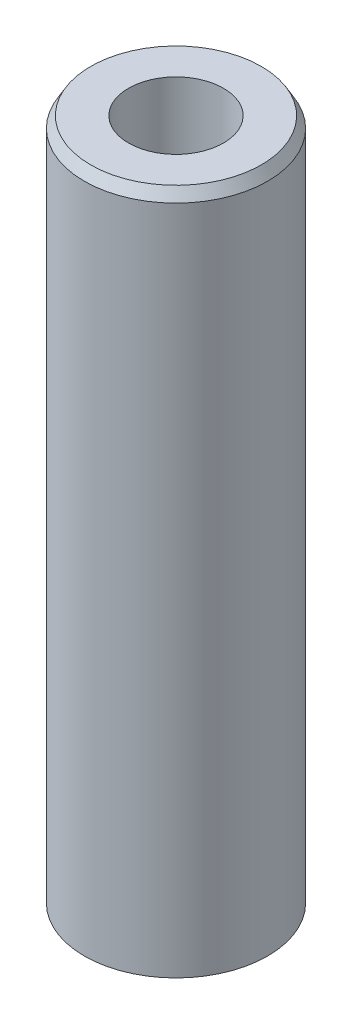
ISO-10303-21;
HEADER;
FILE_DESCRIPTION(('STEP AP214'),'2;1');
FILE_NAME('part.step','',(''),(''),'','','');
FILE_SCHEMA(('AUTOMOTIVE_DESIGN { 1 0 10303 214 1 1 1 1 }'));
ENDSEC;
DATA;
#1=APPLICATION_CONTEXT('core data for automotive mechanical design processes');
#2=APPLICATION_PROTOCOL_DEFINITION('international standard','automotive_design',2000,#1);
#3=PRODUCT_CONTEXT('',#1,'mechanical');
#4=PRODUCT('Part','Part','',(#3));
#5=PRODUCT_RELATED_PRODUCT_CATEGORY('part','',(#4));
#6=PRODUCT_DEFINITION_FORMATION('','',#4);
#7=PRODUCT_DEFINITION_CONTEXT('part definition',#1,'design');
#8=PRODUCT_DEFINITION('design','',#6,#7);
#9=PRODUCT_DEFINITION_SHAPE('','',#8);
#10=(LENGTH_UNIT() NAMED_UNIT(*) SI_UNIT(.MILLI.,.METRE.));
#11=(NAMED_UNIT(*) PLANE_ANGLE_UNIT() SI_UNIT($,.RADIAN.));
#12=(NAMED_UNIT(*) SI_UNIT($,.STERADIAN.) SOLID_ANGLE_UNIT());
#13=UNCERTAINTY_MEASURE_WITH_UNIT(LENGTH_MEASURE(1.E-05),#10,'distance_accuracy_value','');
#14=(GEOMETRIC_REPRESENTATION_CONTEXT(3) GLOBAL_UNCERTAINTY_ASSIGNED_CONTEXT((#13)) GLOBAL_UNIT_ASSIGNED_CONTEXT((#10,
#11,#12)) REPRESENTATION_CONTEXT('',''));
#15=CARTESIAN_POINT('',(0.,0.,0.));
#16=DIRECTION('',(0.,0.,1.));
#17=DIRECTION('',(1.,0.,0.));
#18=AXIS2_PLACEMENT_3D('',#15,#16,#17);
#19=CARTESIAN_POINT('',(0.,375.456607325827,0.));
#20=DIRECTION('',(0.,-1.,0.));
#21=DIRECTION('',(0.,0.,-1.));
#22=AXIS2_PLACEMENT_3D('',#19,#20,#21);
#23=CYLINDRICAL_SURFACE('',#22,50.);
#24=CARTESIAN_POINT('',(0.,369.470889208155,0.));
#25=DIRECTION('',(0.,1.,0.));
#26=DIRECTION('',(0.,0.,1.));
#27=AXIS2_PLACEMENT_3D('',#24,#25,#26);
#28=CIRCLE('',#27,50.);
#29=CARTESIAN_POINT('',(0.,369.470889208155,50.));
#30=VERTEX_POINT('',#29);
#31=EDGE_CURVE('E50',#30,#30,#28,.F.);
#32=ORIENTED_EDGE('',*,*,#31,.T.);
#33=EDGE_LOOP('',(#32));
#34=FACE_BOUND('',#33,.T.);
#35=CARTESIAN_POINT('',(0.,3.45585596653092,0.));
#36=DIRECTION('',(0.,1.,0.));
#37=DIRECTION('',(0.,0.,1.));
#38=AXIS2_PLACEMENT_3D('',#35,#36,#37);
#39=CIRCLE('',#38,50.);
#40=CARTESIAN_POINT('',(0.,3.45585596653092,50.));
#41=VERTEX_POINT('',#40);
#42=EDGE_CURVE('E51',#41,#41,#39,.T.);
#43=ORIENTED_EDGE('',*,*,#42,.T.);
#44=EDGE_LOOP('',(#43));
#45=FACE_BOUND('',#44,.T.);
#46=ADVANCED_FACE('F39',(#34,#45),#23,.T.);
#47=CARTESIAN_POINT('',(0.,375.456607325827,0.));
#48=DIRECTION('',(0.,1.,0.));
#49=DIRECTION('',(0.,0.,1.));
#50=AXIS2_PLACEMENT_3D('',#47,#48,#49);
#51=PLANE('',#50);
#52=CARTESIAN_POINT('',(0.,375.456607325827,0.));
#53=DIRECTION('',(0.,1.,0.));
#54=DIRECTION('',(0.,0.,1.));
#55=AXIS2_PLACEMENT_3D('',#52,#53,#54);
#56=CIRCLE('',#55,46.5441440334691);
#57=CARTESIAN_POINT('',(0.,375.456607325827,46.5441440334691));
#58=VERTEX_POINT('',#57);
#59=EDGE_CURVE('E54',#58,#58,#56,.T.);
#60=ORIENTED_EDGE('',*,*,#59,.T.);
#61=EDGE_LOOP('',(#60));
#62=FACE_BOUND('',#61,.T.);
#63=CARTESIAN_POINT('',(0.,375.456607325827,0.));
#64=DIRECTION('',(0.,1.,0.));
#65=DIRECTION('',(0.,0.,1.));
#66=AXIS2_PLACEMENT_3D('',#63,#64,#65);
#67=CIRCLE('',#66,25.9027345480434);
#68=CARTESIAN_POINT('',(0.,375.456607325827,25.9027345480434));
#69=VERTEX_POINT('',#68);
#70=EDGE_CURVE('E58',#69,#69,#67,.T.);
#71=ORIENTED_EDGE('',*,*,#70,.F.);
#72=EDGE_LOOP('',(#71));
#73=FACE_BOUND('',#72,.T.);
#74=ADVANCED_FACE('F69',(#62,#73),#51,.T.);
#75=CARTESIAN_POINT('',(0.,0.,0.));
#76=DIRECTION('',(0.,1.,0.));
#77=DIRECTION('',(0.,0.,1.));
#78=AXIS2_PLACEMENT_3D('',#75,#76,#77);
#79=PLANE('',#78);
#80=CARTESIAN_POINT('',(0.,0.,0.));
#81=DIRECTION('',(0.,1.,0.));
#82=DIRECTION('',(0.,0.,1.));
#83=AXIS2_PLACEMENT_3D('',#80,#81,#82);
#84=CIRCLE('',#83,44.0142818823284);
#85=CARTESIAN_POINT('',(0.,0.,44.0142818823284));
#86=VERTEX_POINT('',#85);
#87=EDGE_CURVE('E10',#86,#86,#84,.F.);
#88=ORIENTED_EDGE('',*,*,#87,.T.);
#89=EDGE_LOOP('',(#88));
#90=FACE_BOUND('',#89,.T.);
#91=CARTESIAN_POINT('',(0.,0.,0.));
#92=DIRECTION('',(0.,1.,0.));
#93=DIRECTION('',(0.,0.,1.));
#94=AXIS2_PLACEMENT_3D('',#91,#92,#93);
#95=CIRCLE('',#94,25.9027345480434);
#96=CARTESIAN_POINT('',(0.,0.,25.9027345480434));
#97=VERTEX_POINT('',#96);
#98=EDGE_CURVE('E63',#97,#97,#95,.T.);
#99=ORIENTED_EDGE('',*,*,#98,.T.);
#100=EDGE_LOOP('',(#99));
#101=FACE_BOUND('',#100,.T.);
#102=ADVANCED_FACE('F75',(#90,#101),#79,.F.);
#103=CARTESIAN_POINT('',(0.,375.456607325827,0.));
#104=DIRECTION('',(0.,-1.,0.));
#105=DIRECTION('',(0.,0.,-1.));
#106=AXIS2_PLACEMENT_3D('',#103,#104,#105);
#107=CYLINDRICAL_SURFACE('',#106,25.9027345480434);
#108=ORIENTED_EDGE('',*,*,#70,.T.);
#109=EDGE_LOOP('',(#108));
#110=FACE_BOUND('',#109,.T.);
#111=ORIENTED_EDGE('',*,*,#98,.F.);
#112=EDGE_LOOP('',(#111));
#113=FACE_BOUND('',#112,.T.);
#114=ADVANCED_FACE('F70',(#110,#113),#107,.F.);
#115=CARTESIAN_POINT('',(0.,375.456607325827,0.));
#116=DIRECTION('',(0.,-1.,0.));
#117=DIRECTION('',(0.,0.,-1.));
#118=AXIS2_PLACEMENT_3D('',#115,#116,#117);
#119=CONICAL_SURFACE('',#118,46.5441440334691,0.523598775598291);
#120=ORIENTED_EDGE('',*,*,#31,.F.);
#121=EDGE_LOOP('',(#120));
#122=FACE_BOUND('',#121,.T.);
#123=ORIENTED_EDGE('',*,*,#59,.F.);
#124=EDGE_LOOP('',(#123));
#125=FACE_BOUND('',#124,.T.);
#126=ADVANCED_FACE('F81',(#122,#125),#119,.T.);
#127=CARTESIAN_POINT('',(0.,3.45585596653092,0.));
#128=DIRECTION('',(0.,1.,0.));
#129=DIRECTION('',(0.,0.,1.));
#130=AXIS2_PLACEMENT_3D('',#127,#128,#129);
#131=CONICAL_SURFACE('',#130,50.,1.0471975511966);
#132=ORIENTED_EDGE('',*,*,#87,.F.);
#133=EDGE_LOOP('',(#132));
#134=FACE_BOUND('',#133,.T.);
#135=ORIENTED_EDGE('',*,*,#42,.F.);
#136=EDGE_LOOP('',(#135));
#137=FACE_BOUND('',#136,.T.);
#138=ADVANCED_FACE('F45',(#134,#137),#131,.T.);
#139=CLOSED_SHELL('',(#46,#74,#102,#114,#126,#138));
#140=MANIFOLD_SOLID_BREP('B2',#139);
#141=ADVANCED_BREP_SHAPE_REPRESENTATION('',(#18,#140),#14);
#142=SHAPE_DEFINITION_REPRESENTATION(#9,#141);
ENDSEC;
END-ISO-10303-21;
